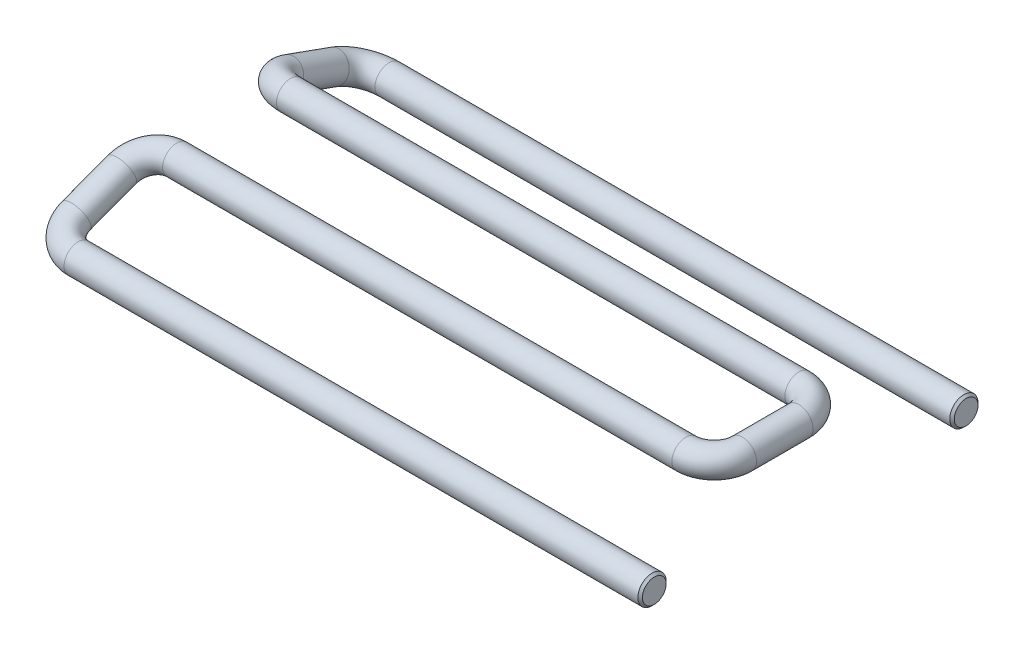
ISO-10303-21;
HEADER;
FILE_DESCRIPTION(('STEP AP214'),'2;1');
FILE_NAME('part.step','',(''),(''),'','','');
FILE_SCHEMA(('AUTOMOTIVE_DESIGN { 1 0 10303 214 1 1 1 1 }'));
ENDSEC;
DATA;
#1=APPLICATION_CONTEXT('core data for automotive mechanical design processes');
#2=APPLICATION_PROTOCOL_DEFINITION('international standard','automotive_design',2000,#1);
#3=PRODUCT_CONTEXT('',#1,'mechanical');
#4=PRODUCT('Part','Part','',(#3));
#5=PRODUCT_RELATED_PRODUCT_CATEGORY('part','',(#4));
#6=PRODUCT_DEFINITION_FORMATION('','',#4);
#7=PRODUCT_DEFINITION_CONTEXT('part definition',#1,'design');
#8=PRODUCT_DEFINITION('design','',#6,#7);
#9=PRODUCT_DEFINITION_SHAPE('','',#8);
#10=(LENGTH_UNIT() NAMED_UNIT(*) SI_UNIT(.MILLI.,.METRE.));
#11=(NAMED_UNIT(*) PLANE_ANGLE_UNIT() SI_UNIT($,.RADIAN.));
#12=(NAMED_UNIT(*) SI_UNIT($,.STERADIAN.) SOLID_ANGLE_UNIT());
#13=UNCERTAINTY_MEASURE_WITH_UNIT(LENGTH_MEASURE(1.E-05),#10,'distance_accuracy_value','');
#14=(GEOMETRIC_REPRESENTATION_CONTEXT(3) GLOBAL_UNCERTAINTY_ASSIGNED_CONTEXT((#13)) GLOBAL_UNIT_ASSIGNED_CONTEXT((#10,
#11,#12)) REPRESENTATION_CONTEXT('',''));
#15=CARTESIAN_POINT('',(0.,0.,0.));
#16=DIRECTION('',(0.,0.,1.));
#17=DIRECTION('',(1.,0.,0.));
#18=AXIS2_PLACEMENT_3D('',#15,#16,#17);
#19=CARTESIAN_POINT('',(3.19446360484116,0.,0.));
#20=DIRECTION('',(1.,0.,0.));
#21=DIRECTION('',(0.,0.,-1.));
#22=AXIS2_PLACEMENT_3D('',#19,#20,#21);
#23=CYLINDRICAL_SURFACE('',#22,1.5875);
#24=CARTESIAN_POINT('',(67.8373206797429,0.,0.));
#25=DIRECTION('',(-1.,0.,0.));
#26=DIRECTION('',(0.,0.,1.));
#27=AXIS2_PLACEMENT_3D('',#24,#25,#26);
#28=CIRCLE('',#27,1.5875);
#29=CARTESIAN_POINT('',(67.8373206797429,0.,1.58749999999999));
#30=VERTEX_POINT('',#29);
#31=EDGE_CURVE('E52',#30,#30,#28,.T.);
#32=ORIENTED_EDGE('',*,*,#31,.T.);
#33=EDGE_LOOP('',(#32));
#34=FACE_BOUND('',#33,.T.);
#35=CARTESIAN_POINT('',(3.19446360484116,0.,0.));
#36=DIRECTION('',(-1.,0.,0.));
#37=DIRECTION('',(0.,0.,1.));
#38=AXIS2_PLACEMENT_3D('',#35,#36,#37);
#39=CIRCLE('',#38,1.5875);
#40=CARTESIAN_POINT('',(3.19446360484115,-0.542880427873886,-1.49178989506951));
#41=VERTEX_POINT('',#40);
#42=EDGE_CURVE('E57',#41,#41,#39,.T.);
#43=ORIENTED_EDGE('',*,*,#42,.F.);
#44=EDGE_LOOP('',(#43));
#45=FACE_BOUND('',#44,.T.);
#46=ADVANCED_FACE('F37',(#34,#45),#23,.T.);
#47=CARTESIAN_POINT('',(3.19446360484116,1.08576085574776,2.983579790139));
#48=DIRECTION('',(0.,-0.93971017012252,0.341971923070162));
#49=DIRECTION('',(0.,-0.341971923070162,-0.93971017012252));
#50=AXIS2_PLACEMENT_3D('',#47,#48,#49);
#51=TOROIDAL_SURFACE('',#50,3.17500000000001,1.5875);
#52=CARTESIAN_POINT('',(0.0195228988080735,1.0923964609506,3.0018138768384));
#53=DIRECTION('',(0.00611147949174005,0.34196553665382,0.939692620785908));
#54=DIRECTION('',(0.939692620785909,-0.323318445405078,0.111548022400013));
#55=AXIS2_PLACEMENT_3D('',#52,#53,#54);
#56=CIRCLE('',#55,1.5875);
#57=CARTESIAN_POINT('',(-1.56794745420847,1.09571426355202,3.0109309201881));
#58=VERTEX_POINT('',#57);
#59=EDGE_CURVE('E60',#58,#58,#56,.T.);
#60=CARTESIAN_POINT('',(3.19446360484116,1.08576085574776,2.983579790139));
#61=DIRECTION('',(0.,-0.93971017012252,0.341971923070162));
#62=DIRECTION('',(0.,-0.341971923070162,-0.93971017012252));
#63=AXIS2_PLACEMENT_3D('',#60,#61,#62);
#64=CIRCLE('',#63,4.76250000000001);
#65=EDGE_CURVE('',#58,#41,#64,.T.);
#66=ORIENTED_EDGE('',*,*,#59,.F.);
#67=ORIENTED_EDGE('',*,*,#42,.T.);
#68=ORIENTED_EDGE('',*,*,#65,.T.);
#69=ORIENTED_EDGE('',*,*,#65,.F.);
#70=EDGE_LOOP('',(#66,#68,#67,#69));
#71=FACE_BOUND('',#70,.T.);
#72=ADVANCED_FACE('F153',(#71),#51,.T.);
#73=CARTESIAN_POINT('',(0.0529866525479199,2.96484821695698,8.14715429656038));
#74=DIRECTION('',(-0.00611147949173586,-0.341965536653818,-0.939692620785908));
#75=DIRECTION('',(0.,0.93971017012252,-0.341971923070162));
#76=AXIS2_PLACEMENT_3D('',#73,#74,#75);
#77=CYLINDRICAL_SURFACE('',#76,1.5875);
#78=CARTESIAN_POINT('',(0.0529866525479199,2.96484821695698,8.14715429656038));
#79=DIRECTION('',(0.00611147949174005,0.34196553665382,0.939692620785908));
#80=DIRECTION('',(0.939692620785909,-0.323318445405078,0.111548022400013));
#81=AXIS2_PLACEMENT_3D('',#78,#79,#80);
#82=CIRCLE('',#81,1.5875);
#83=CARTESIAN_POINT('',(-1.53448370046862,2.96816601955839,8.15627133991008));
#84=VERTEX_POINT('',#83);
#85=EDGE_CURVE('E63',#84,#84,#82,.T.);
#86=ORIENTED_EDGE('',*,*,#85,.F.);
#87=EDGE_LOOP('',(#86));
#88=FACE_BOUND('',#87,.T.);
#89=ORIENTED_EDGE('',*,*,#59,.T.);
#90=EDGE_LOOP('',(#89));
#91=FACE_BOUND('',#90,.T.);
#92=ADVANCED_FACE('F147',(#88,#91),#77,.T.);
#93=CARTESIAN_POINT('',(3.22792735858101,2.95821261175414,8.12892020986099));
#94=DIRECTION('',(0.,-0.93971017012252,0.341971923070162));
#95=DIRECTION('',(0.,-0.341971923070162,-0.93971017012252));
#96=AXIS2_PLACEMENT_3D('',#93,#94,#95);
#97=TOROIDAL_SURFACE('',#96,3.17500000000001,1.5875);
#98=CARTESIAN_POINT('',(3.22792735858102,4.04397346750191,11.1125));
#99=DIRECTION('',(1.,0.,0.));
#100=DIRECTION('',(0.,-0.642708988010773,-0.766110407663392));
#101=AXIS2_PLACEMENT_3D('',#98,#99,#100);
#102=CIRCLE('',#101,1.5875);
#103=CARTESIAN_POINT('',(3.22792735858102,4.58685389537579,12.6042898950695));
#104=VERTEX_POINT('',#103);
#105=EDGE_CURVE('E66',#104,#104,#102,.T.);
#106=CARTESIAN_POINT('',(3.22792735858101,2.95821261175414,8.12892020986099));
#107=DIRECTION('',(0.,-0.93971017012252,0.341971923070162));
#108=DIRECTION('',(0.,-0.341971923070162,-0.93971017012252));
#109=AXIS2_PLACEMENT_3D('',#106,#107,#108);
#110=CIRCLE('',#109,4.76250000000001);
#111=EDGE_CURVE('',#104,#84,#110,.T.);
#112=ORIENTED_EDGE('',*,*,#105,.F.);
#113=ORIENTED_EDGE('',*,*,#85,.T.);
#114=ORIENTED_EDGE('',*,*,#111,.T.);
#115=ORIENTED_EDGE('',*,*,#111,.F.);
#116=EDGE_LOOP('',(#112,#114,#113,#115));
#117=FACE_BOUND('',#116,.T.);
#118=ADVANCED_FACE('F141',(#117),#97,.T.);
#119=CARTESIAN_POINT('',(60.3972723732736,4.04397346750191,11.1125));
#120=DIRECTION('',(-1.,0.,0.));
#121=DIRECTION('',(0.,-1.,0.));
#122=AXIS2_PLACEMENT_3D('',#119,#120,#121);
#123=CYLINDRICAL_SURFACE('',#122,1.5875);
#124=CARTESIAN_POINT('',(60.3972723732736,4.04397346750191,11.1125));
#125=DIRECTION('',(1.,0.,0.));
#126=DIRECTION('',(0.,-0.642708988010773,-0.766110407663392));
#127=AXIS2_PLACEMENT_3D('',#124,#125,#126);
#128=CIRCLE('',#127,1.5875);
#129=CARTESIAN_POINT('',(60.3972723732736,4.04397346750191,9.52499999999999));
#130=VERTEX_POINT('',#129);
#131=EDGE_CURVE('E69',#130,#130,#128,.T.);
#132=ORIENTED_EDGE('',*,*,#131,.F.);
#133=EDGE_LOOP('',(#132));
#134=FACE_BOUND('',#133,.T.);
#135=ORIENTED_EDGE('',*,*,#105,.T.);
#136=EDGE_LOOP('',(#135));
#137=FACE_BOUND('',#136,.T.);
#138=ADVANCED_FACE('F135',(#134,#137),#123,.T.);
#139=CARTESIAN_POINT('',(60.3972723732736,4.04397346750191,14.2875));
#140=DIRECTION('',(0.,1.,0.));
#141=DIRECTION('',(0.,0.,1.));
#142=AXIS2_PLACEMENT_3D('',#139,#140,#141);
#143=TOROIDAL_SURFACE('',#142,3.175,1.5875);
#144=CARTESIAN_POINT('',(63.5722723732736,4.04397346750191,14.2875));
#145=DIRECTION('',(0.,0.,1.));
#146=DIRECTION('',(0.766110407663392,-0.642708988010773,0.));
#147=AXIS2_PLACEMENT_3D('',#144,#145,#146);
#148=CIRCLE('',#147,1.5875);
#149=CARTESIAN_POINT('',(65.1597723732736,4.04397346750191,14.2875));
#150=VERTEX_POINT('',#149);
#151=EDGE_CURVE('E72',#150,#150,#148,.T.);
#152=CARTESIAN_POINT('',(60.3972723732736,4.04397346750191,14.2875));
#153=DIRECTION('',(0.,1.,0.));
#154=DIRECTION('',(0.,0.,1.));
#155=AXIS2_PLACEMENT_3D('',#152,#153,#154);
#156=CIRCLE('',#155,4.7625);
#157=EDGE_CURVE('',#150,#130,#156,.T.);
#158=ORIENTED_EDGE('',*,*,#151,.F.);
#159=ORIENTED_EDGE('',*,*,#131,.T.);
#160=ORIENTED_EDGE('',*,*,#157,.T.);
#161=ORIENTED_EDGE('',*,*,#157,.F.);
#162=EDGE_LOOP('',(#158,#160,#159,#161));
#163=FACE_BOUND('',#162,.T.);
#164=ADVANCED_FACE('F129',(#163),#143,.T.);
#165=CARTESIAN_POINT('',(63.5722723732736,4.04397346750191,20.6375));
#166=DIRECTION('',(0.,0.,-1.));
#167=DIRECTION('',(-1.,0.,0.));
#168=AXIS2_PLACEMENT_3D('',#165,#166,#167);
#169=CYLINDRICAL_SURFACE('',#168,1.5875);
#170=CARTESIAN_POINT('',(63.5722723732736,4.04397346750191,20.6375));
#171=DIRECTION('',(0.,0.,1.));
#172=DIRECTION('',(0.766110407663392,-0.642708988010773,0.));
#173=AXIS2_PLACEMENT_3D('',#170,#171,#172);
#174=CIRCLE('',#173,1.5875);
#175=CARTESIAN_POINT('',(65.1597723732736,4.04397346750191,20.6375));
#176=VERTEX_POINT('',#175);
#177=EDGE_CURVE('E75',#176,#176,#174,.T.);
#178=ORIENTED_EDGE('',*,*,#177,.F.);
#179=EDGE_LOOP('',(#178));
#180=FACE_BOUND('',#179,.T.);
#181=ORIENTED_EDGE('',*,*,#151,.T.);
#182=EDGE_LOOP('',(#181));
#183=FACE_BOUND('',#182,.T.);
#184=ADVANCED_FACE('F123',(#180,#183),#169,.T.);
#185=CARTESIAN_POINT('',(60.3972723732736,4.04397346750191,20.6375));
#186=DIRECTION('',(0.,1.,0.));
#187=DIRECTION('',(0.,0.,1.));
#188=AXIS2_PLACEMENT_3D('',#185,#186,#187);
#189=TOROIDAL_SURFACE('',#188,3.17499999999999,1.5875);
#190=CARTESIAN_POINT('',(60.3972723732736,4.04397346750191,23.8125));
#191=DIRECTION('',(-1.,0.,0.));
#192=DIRECTION('',(0.,-0.642708988010773,0.766110407663392));
#193=AXIS2_PLACEMENT_3D('',#190,#191,#192);
#194=CIRCLE('',#193,1.5875);
#195=CARTESIAN_POINT('',(60.3972723732736,4.04397346750191,25.4));
#196=VERTEX_POINT('',#195);
#197=EDGE_CURVE('E78',#196,#196,#194,.T.);
#198=CARTESIAN_POINT('',(60.3972723732736,4.04397346750191,20.6375));
#199=DIRECTION('',(0.,1.,0.));
#200=DIRECTION('',(0.,0.,1.));
#201=AXIS2_PLACEMENT_3D('',#198,#199,#200);
#202=CIRCLE('',#201,4.76249999999999);
#203=EDGE_CURVE('',#196,#176,#202,.T.);
#204=ORIENTED_EDGE('',*,*,#197,.F.);
#205=ORIENTED_EDGE('',*,*,#177,.T.);
#206=ORIENTED_EDGE('',*,*,#203,.T.);
#207=ORIENTED_EDGE('',*,*,#203,.F.);
#208=EDGE_LOOP('',(#204,#206,#205,#207));
#209=FACE_BOUND('',#208,.T.);
#210=ADVANCED_FACE('F117',(#209),#189,.T.);
#211=CARTESIAN_POINT('',(3.12219123157029,4.04397346750191,23.8125));
#212=DIRECTION('',(1.,0.,0.));
#213=DIRECTION('',(0.,0.,-1.));
#214=AXIS2_PLACEMENT_3D('',#211,#212,#213);
#215=CYLINDRICAL_SURFACE('',#214,1.5875);
#216=CARTESIAN_POINT('',(3.12219123157029,4.04397346750191,23.8125));
#217=DIRECTION('',(-1.,0.,0.));
#218=DIRECTION('',(0.,-0.642708988010773,0.766110407663392));
#219=AXIS2_PLACEMENT_3D('',#216,#217,#218);
#220=CIRCLE('',#219,1.5875);
#221=CARTESIAN_POINT('',(3.12219123157029,4.58685389537579,22.3207101049305));
#222=VERTEX_POINT('',#221);
#223=EDGE_CURVE('E81',#222,#222,#220,.T.);
#224=ORIENTED_EDGE('',*,*,#223,.F.);
#225=EDGE_LOOP('',(#224));
#226=FACE_BOUND('',#225,.T.);
#227=ORIENTED_EDGE('',*,*,#197,.T.);
#228=EDGE_LOOP('',(#227));
#229=FACE_BOUND('',#228,.T.);
#230=ADVANCED_FACE('F111',(#226,#229),#215,.T.);
#231=CARTESIAN_POINT('',(3.1221912315703,2.95821261175414,26.796079790139));
#232=DIRECTION('',(0.,-0.93971017012252,-0.341971923070161));
#233=DIRECTION('',(0.,0.341971923070161,-0.93971017012252));
#234=AXIS2_PLACEMENT_3D('',#231,#232,#233);
#235=TOROIDAL_SURFACE('',#234,3.17500000000001,1.5875);
#236=CARTESIAN_POINT('',(-0.0527494744627968,2.95157700655165,26.8143138768374));
#237=DIRECTION('',(0.00611147949141615,-0.341965536653817,0.939692620785911));
#238=DIRECTION('',(0.93969262078591,-0.319390542605799,-0.12234156993631));
#239=AXIS2_PLACEMENT_3D('',#236,#237,#238);
#240=CIRCLE('',#239,1.5875);
#241=CARTESIAN_POINT('',(-1.64021982747934,2.94825920395041,26.8234309201867));
#242=VERTEX_POINT('',#241);
#243=EDGE_CURVE('E84',#242,#242,#240,.T.);
#244=CARTESIAN_POINT('',(3.1221912315703,2.95821261175414,26.796079790139));
#245=DIRECTION('',(0.,-0.93971017012252,-0.341971923070161));
#246=DIRECTION('',(0.,0.341971923070161,-0.93971017012252));
#247=AXIS2_PLACEMENT_3D('',#244,#245,#246);
#248=CIRCLE('',#247,4.76250000000001);
#249=EDGE_CURVE('',#242,#222,#248,.T.);
#250=ORIENTED_EDGE('',*,*,#243,.F.);
#251=ORIENTED_EDGE('',*,*,#223,.T.);
#252=ORIENTED_EDGE('',*,*,#249,.T.);
#253=ORIENTED_EDGE('',*,*,#249,.F.);
#254=EDGE_LOOP('',(#250,#252,#251,#253));
#255=FACE_BOUND('',#254,.T.);
#256=ADVANCED_FACE('F105',(#255),#235,.T.);
#257=CARTESIAN_POINT('',(-0.019285720724703,1.07912525054528,31.9596542965594));
#258=DIRECTION('',(-0.00611147949141579,0.341965536653818,-0.93969262078591));
#259=DIRECTION('',(0.,0.93971017012252,0.341971923070162));
#260=AXIS2_PLACEMENT_3D('',#257,#258,#259);
#261=CYLINDRICAL_SURFACE('',#260,1.5875);
#262=CARTESIAN_POINT('',(-0.019285720724703,1.07912525054528,31.9596542965594));
#263=DIRECTION('',(0.00611147949141615,-0.341965536653817,0.939692620785911));
#264=DIRECTION('',(0.93969262078591,-0.319390542605799,-0.12234156993631));
#265=AXIS2_PLACEMENT_3D('',#262,#263,#264);
#266=CIRCLE('',#265,1.5875);
#267=CARTESIAN_POINT('',(-1.60675607374124,1.07580744794403,31.9687713399087));
#268=VERTEX_POINT('',#267);
#269=EDGE_CURVE('E87',#268,#268,#266,.T.);
#270=ORIENTED_EDGE('',*,*,#269,.F.);
#271=EDGE_LOOP('',(#270));
#272=FACE_BOUND('',#271,.T.);
#273=ORIENTED_EDGE('',*,*,#243,.T.);
#274=EDGE_LOOP('',(#273));
#275=FACE_BOUND('',#274,.T.);
#276=ADVANCED_FACE('F99',(#272,#275),#261,.T.);
#277=CARTESIAN_POINT('',(3.15565498530839,1.08576085574776,31.941420209861));
#278=DIRECTION('',(0.,-0.93971017012252,-0.341971923070161));
#279=DIRECTION('',(0.,0.341971923070161,-0.93971017012252));
#280=AXIS2_PLACEMENT_3D('',#277,#278,#279);
#281=TOROIDAL_SURFACE('',#280,3.175,1.5875);
#282=CARTESIAN_POINT('',(3.1556549853084,0.,34.925));
#283=DIRECTION('',(1.,0.,0.));
#284=DIRECTION('',(0.,0.,-1.));
#285=AXIS2_PLACEMENT_3D('',#282,#283,#284);
#286=CIRCLE('',#285,1.5875);
#287=CARTESIAN_POINT('',(3.1556549853084,-0.54288042787388,36.4167898950695));
#288=VERTEX_POINT('',#287);
#289=EDGE_CURVE('E90',#288,#288,#286,.T.);
#290=CARTESIAN_POINT('',(3.15565498530839,1.08576085574776,31.941420209861));
#291=DIRECTION('',(0.,-0.93971017012252,-0.341971923070161));
#292=DIRECTION('',(0.,0.341971923070161,-0.93971017012252));
#293=AXIS2_PLACEMENT_3D('',#290,#291,#292);
#294=CIRCLE('',#293,4.7625);
#295=EDGE_CURVE('',#288,#268,#294,.T.);
#296=ORIENTED_EDGE('',*,*,#289,.F.);
#297=ORIENTED_EDGE('',*,*,#269,.T.);
#298=ORIENTED_EDGE('',*,*,#295,.T.);
#299=ORIENTED_EDGE('',*,*,#295,.F.);
#300=EDGE_LOOP('',(#296,#298,#297,#299));
#301=FACE_BOUND('',#300,.T.);
#302=ADVANCED_FACE('F96',(#301),#281,.T.);
#303=CARTESIAN_POINT('',(3.1556549853084,0.,34.925));
#304=DIRECTION('',(1.,0.,0.));
#305=DIRECTION('',(0.,1.,0.));
#306=AXIS2_PLACEMENT_3D('',#303,#304,#305);
#307=CYLINDRICAL_SURFACE('',#306,1.5875);
#308=CARTESIAN_POINT('',(67.691,0.,34.925));
#309=DIRECTION('',(1.,0.,0.));
#310=DIRECTION('',(0.,1.,0.));
#311=AXIS2_PLACEMENT_3D('',#308,#309,#310);
#312=CIRCLE('',#311,1.5875);
#313=CARTESIAN_POINT('',(67.691,1.5875,34.925));
#314=VERTEX_POINT('',#313);
#315=EDGE_CURVE('E10',#314,#314,#312,.F.);
#316=ORIENTED_EDGE('',*,*,#315,.T.);
#317=EDGE_LOOP('',(#316));
#318=FACE_BOUND('',#317,.T.);
#319=ORIENTED_EDGE('',*,*,#289,.T.);
#320=EDGE_LOOP('',(#319));
#321=FACE_BOUND('',#320,.T.);
#322=ADVANCED_FACE('F94',(#318,#321),#307,.T.);
#323=CARTESIAN_POINT('',(68.0913206797429,0.,0.));
#324=DIRECTION('',(-1.,0.,0.));
#325=DIRECTION('',(0.,0.,1.));
#326=AXIS2_PLACEMENT_3D('',#323,#324,#325);
#327=PLANE('',#326);
#328=CARTESIAN_POINT('',(68.0913206797429,0.,0.));
#329=DIRECTION('',(-1.,0.,0.));
#330=DIRECTION('',(0.,-1.,0.));
#331=AXIS2_PLACEMENT_3D('',#328,#329,#330);
#332=CIRCLE('',#331,1.33349999999999);
#333=CARTESIAN_POINT('',(68.0913206797429,-1.33349999999999,0.));
#334=VERTEX_POINT('',#333);
#335=EDGE_CURVE('E48',#334,#334,#332,.F.);
#336=ORIENTED_EDGE('',*,*,#335,.T.);
#337=EDGE_LOOP('',(#336));
#338=FACE_BOUND('',#337,.T.);
#339=ADVANCED_FACE('F177',(#338),#327,.F.);
#340=CARTESIAN_POINT('',(67.945,0.,34.925));
#341=DIRECTION('',(1.,0.,0.));
#342=DIRECTION('',(0.,0.,-1.));
#343=AXIS2_PLACEMENT_3D('',#340,#341,#342);
#344=PLANE('',#343);
#345=CARTESIAN_POINT('',(67.945,0.,34.925));
#346=DIRECTION('',(1.,0.,0.));
#347=DIRECTION('',(0.,0.,-1.));
#348=AXIS2_PLACEMENT_3D('',#345,#346,#347);
#349=CIRCLE('',#348,1.33349999999999);
#350=CARTESIAN_POINT('',(67.945,0.,33.5915));
#351=VERTEX_POINT('',#350);
#352=EDGE_CURVE('E44',#351,#351,#349,.T.);
#353=ORIENTED_EDGE('',*,*,#352,.T.);
#354=EDGE_LOOP('',(#353));
#355=FACE_BOUND('',#354,.T.);
#356=ADVANCED_FACE('F170',(#355),#344,.T.);
#357=CARTESIAN_POINT('',(67.8373206797429,0.,0.));
#358=DIRECTION('',(-1.,0.,0.));
#359=DIRECTION('',(0.,0.,1.));
#360=AXIS2_PLACEMENT_3D('',#357,#358,#359);
#361=CONICAL_SURFACE('',#360,1.5875,0.785398163397424);
#362=ORIENTED_EDGE('',*,*,#335,.F.);
#363=EDGE_LOOP('',(#362));
#364=FACE_BOUND('',#363,.T.);
#365=ORIENTED_EDGE('',*,*,#31,.F.);
#366=EDGE_LOOP('',(#365));
#367=FACE_BOUND('',#366,.T.);
#368=ADVANCED_FACE('F168',(#364,#367),#361,.T.);
#369=CARTESIAN_POINT('',(67.945,0.,34.925));
#370=DIRECTION('',(-1.,0.,0.));
#371=DIRECTION('',(0.,-1.,0.));
#372=AXIS2_PLACEMENT_3D('',#369,#370,#371);
#373=CONICAL_SURFACE('',#372,1.33349999999999,0.785398163397449);
#374=ORIENTED_EDGE('',*,*,#315,.F.);
#375=EDGE_LOOP('',(#374));
#376=FACE_BOUND('',#375,.T.);
#377=ORIENTED_EDGE('',*,*,#352,.F.);
#378=EDGE_LOOP('',(#377));
#379=FACE_BOUND('',#378,.T.);
#380=ADVANCED_FACE('F39',(#376,#379),#373,.T.);
#381=CLOSED_SHELL('',(#46,#72,#92,#118,#138,#164,#184,#210,#230,#256,#276,#302,#322,#339,#356,
#368,#380));
#382=MANIFOLD_SOLID_BREP('B2',#381);
#383=ADVANCED_BREP_SHAPE_REPRESENTATION('',(#18,#382),#14);
#384=SHAPE_DEFINITION_REPRESENTATION(#9,#383);
ENDSEC;
END-ISO-10303-21;
